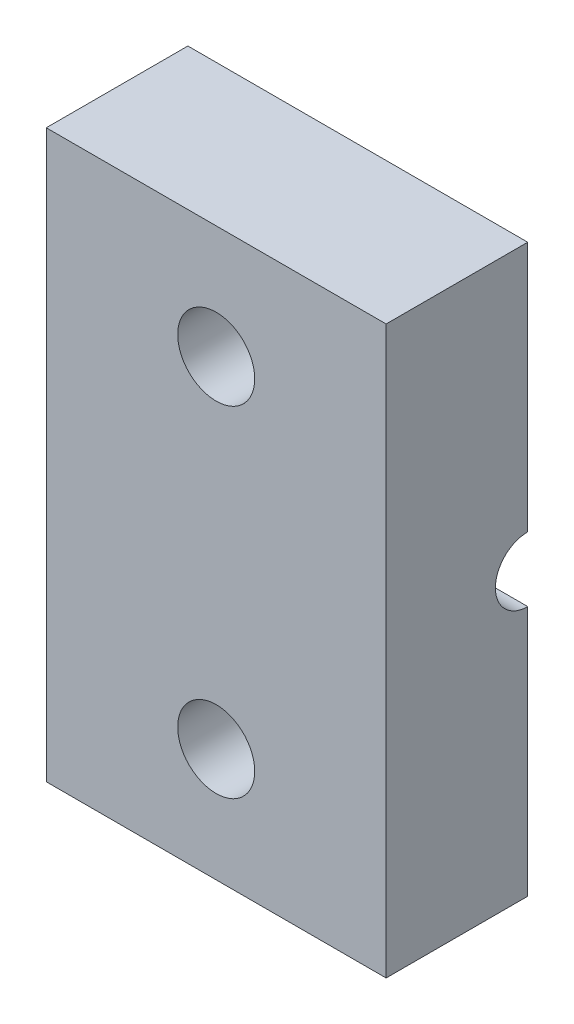
ISO-10303-21;
HEADER;
FILE_DESCRIPTION(('STEP AP214'),'2;1');
FILE_NAME('part.step','',(''),(''),'','','');
FILE_SCHEMA(('AUTOMOTIVE_DESIGN { 1 0 10303 214 1 1 1 1 }'));
ENDSEC;
DATA;
#1=APPLICATION_CONTEXT('core data for automotive mechanical design processes');
#2=APPLICATION_PROTOCOL_DEFINITION('international standard','automotive_design',2000,#1);
#3=PRODUCT_CONTEXT('',#1,'mechanical');
#4=PRODUCT('Part','Part','',(#3));
#5=PRODUCT_RELATED_PRODUCT_CATEGORY('part','',(#4));
#6=PRODUCT_DEFINITION_FORMATION('','',#4);
#7=PRODUCT_DEFINITION_CONTEXT('part definition',#1,'design');
#8=PRODUCT_DEFINITION('design','',#6,#7);
#9=PRODUCT_DEFINITION_SHAPE('','',#8);
#10=(LENGTH_UNIT() NAMED_UNIT(*) SI_UNIT(.MILLI.,.METRE.));
#11=(NAMED_UNIT(*) PLANE_ANGLE_UNIT() SI_UNIT($,.RADIAN.));
#12=(NAMED_UNIT(*) SI_UNIT($,.STERADIAN.) SOLID_ANGLE_UNIT());
#13=UNCERTAINTY_MEASURE_WITH_UNIT(LENGTH_MEASURE(1.E-05),#10,'distance_accuracy_value','');
#14=(GEOMETRIC_REPRESENTATION_CONTEXT(3) GLOBAL_UNCERTAINTY_ASSIGNED_CONTEXT((#13)) GLOBAL_UNIT_ASSIGNED_CONTEXT((#10,
#11,#12)) REPRESENTATION_CONTEXT('',''));
#15=CARTESIAN_POINT('',(0.,0.,0.));
#16=DIRECTION('',(0.,0.,1.));
#17=DIRECTION('',(1.,0.,0.));
#18=AXIS2_PLACEMENT_3D('',#15,#16,#17);
#19=CARTESIAN_POINT('',(0.,0.,0.));
#20=DIRECTION('',(0.,0.,1.));
#21=DIRECTION('',(1.,0.,0.));
#22=AXIS2_PLACEMENT_3D('',#19,#20,#21);
#23=PLANE('',#22);
#24=CARTESIAN_POINT('',(0.,7.62,0.));
#25=DIRECTION('',(0.,0.,1.));
#26=DIRECTION('',(1.,0.,0.));
#27=AXIS2_PLACEMENT_3D('',#24,#25,#26);
#28=CIRCLE('',#27,1.7272);
#29=CARTESIAN_POINT('',(1.7272,7.62,0.));
#30=VERTEX_POINT('',#29);
#31=EDGE_CURVE('E178',#30,#30,#28,.T.);
#32=ORIENTED_EDGE('',*,*,#31,.T.);
#33=EDGE_LOOP('',(#32));
#34=FACE_BOUND('',#33,.T.);
#35=DIRECTION('',(0.,1.,0.));
#36=VECTOR('',#35,1.);
#37=CARTESIAN_POINT('',(7.62,-12.7,0.));
#38=LINE('',#37,#36);
#39=CARTESIAN_POINT('',(7.62,1.45,0.));
#40=VERTEX_POINT('',#39);
#41=CARTESIAN_POINT('',(7.62,12.7,0.));
#42=VERTEX_POINT('',#41);
#43=EDGE_CURVE('E109',#40,#42,#38,.T.);
#44=ORIENTED_EDGE('',*,*,#43,.F.);
#45=DIRECTION('',(-1.,0.,0.));
#46=VECTOR('',#45,1.);
#47=CARTESIAN_POINT('',(7.62,1.45,0.));
#48=LINE('',#47,#46);
#49=CARTESIAN_POINT('',(-7.62,1.45,0.));
#50=VERTEX_POINT('',#49);
#51=EDGE_CURVE('E11',#40,#50,#48,.T.);
#52=ORIENTED_EDGE('',*,*,#51,.T.);
#53=DIRECTION('',(0.,-1.,0.));
#54=VECTOR('',#53,1.);
#55=CARTESIAN_POINT('',(-7.62,-12.7,0.));
#56=LINE('',#55,#54);
#57=CARTESIAN_POINT('',(-7.62,12.7,0.));
#58=VERTEX_POINT('',#57);
#59=EDGE_CURVE('E108',#58,#50,#56,.T.);
#60=ORIENTED_EDGE('',*,*,#59,.F.);
#61=DIRECTION('',(-1.,0.,0.));
#62=VECTOR('',#61,1.);
#63=CARTESIAN_POINT('',(7.62,12.7,0.));
#64=LINE('',#63,#62);
#65=EDGE_CURVE('E83',#42,#58,#64,.T.);
#66=ORIENTED_EDGE('',*,*,#65,.F.);
#67=EDGE_LOOP('',(#44,#52,#60,#66));
#68=FACE_BOUND('',#67,.T.);
#69=ADVANCED_FACE('F38',(#34,#68),#23,.F.);
#70=CARTESIAN_POINT('',(-7.62,-12.7,6.35));
#71=DIRECTION('',(1.,0.,0.));
#72=DIRECTION('',(0.,0.,-1.));
#73=AXIS2_PLACEMENT_3D('',#70,#71,#72);
#74=PLANE('',#73);
#75=ORIENTED_EDGE('',*,*,#59,.T.);
#76=CARTESIAN_POINT('',(-7.62,0.,0.));
#77=DIRECTION('',(-1.,0.,0.));
#78=DIRECTION('',(0.,0.,1.));
#79=AXIS2_PLACEMENT_3D('',#76,#77,#78);
#80=CIRCLE('',#79,1.45);
#81=CARTESIAN_POINT('',(-7.62,-1.45,0.));
#82=VERTEX_POINT('',#81);
#83=EDGE_CURVE('E99',#82,#50,#80,.T.);
#84=ORIENTED_EDGE('',*,*,#83,.F.);
#85=CARTESIAN_POINT('',(-7.62,-12.7,0.));
#86=VERTEX_POINT('',#85);
#87=EDGE_CURVE('E113',#82,#86,#56,.T.);
#88=ORIENTED_EDGE('',*,*,#87,.T.);
#89=DIRECTION('',(0.,0.,-1.));
#90=VECTOR('',#89,1.);
#91=CARTESIAN_POINT('',(-7.62,-12.7,6.35));
#92=LINE('',#91,#90);
#93=CARTESIAN_POINT('',(-7.62,-12.7,6.35));
#94=VERTEX_POINT('',#93);
#95=EDGE_CURVE('E131',#94,#86,#92,.T.);
#96=ORIENTED_EDGE('',*,*,#95,.F.);
#97=DIRECTION('',(0.,-1.,0.));
#98=VECTOR('',#97,1.);
#99=CARTESIAN_POINT('',(-7.62,-12.7,6.35));
#100=LINE('',#99,#98);
#101=CARTESIAN_POINT('',(-7.62,12.7,6.35));
#102=VERTEX_POINT('',#101);
#103=EDGE_CURVE('E124',#102,#94,#100,.T.);
#104=ORIENTED_EDGE('',*,*,#103,.F.);
#105=DIRECTION('',(0.,0.,-1.));
#106=VECTOR('',#105,1.);
#107=CARTESIAN_POINT('',(-7.62,12.7,6.35));
#108=LINE('',#107,#106);
#109=EDGE_CURVE('E111',#102,#58,#108,.T.);
#110=ORIENTED_EDGE('',*,*,#109,.T.);
#111=EDGE_LOOP('',(#75,#84,#88,#96,#104,#110));
#112=FACE_BOUND('',#111,.T.);
#113=ADVANCED_FACE('F40',(#112),#74,.F.);
#114=CARTESIAN_POINT('',(7.62,-12.7,6.35));
#115=DIRECTION('',(0.,1.,0.));
#116=DIRECTION('',(-1.,0.,0.));
#117=AXIS2_PLACEMENT_3D('',#114,#115,#116);
#118=PLANE('',#117);
#119=DIRECTION('',(1.,0.,0.));
#120=VECTOR('',#119,1.);
#121=CARTESIAN_POINT('',(7.62,-12.7,0.));
#122=LINE('',#121,#120);
#123=CARTESIAN_POINT('',(7.62,-12.7,0.));
#124=VERTEX_POINT('',#123);
#125=EDGE_CURVE('E112',#86,#124,#122,.T.);
#126=ORIENTED_EDGE('',*,*,#125,.T.);
#127=DIRECTION('',(0.,0.,-1.));
#128=VECTOR('',#127,1.);
#129=CARTESIAN_POINT('',(7.62,-12.7,6.35));
#130=LINE('',#129,#128);
#131=CARTESIAN_POINT('',(7.62,-12.7,6.35));
#132=VERTEX_POINT('',#131);
#133=EDGE_CURVE('E128',#132,#124,#130,.T.);
#134=ORIENTED_EDGE('',*,*,#133,.F.);
#135=DIRECTION('',(1.,0.,0.));
#136=VECTOR('',#135,1.);
#137=CARTESIAN_POINT('',(7.62,-12.7,6.35));
#138=LINE('',#137,#136);
#139=EDGE_CURVE('E91',#94,#132,#138,.T.);
#140=ORIENTED_EDGE('',*,*,#139,.F.);
#141=ORIENTED_EDGE('',*,*,#95,.T.);
#142=EDGE_LOOP('',(#126,#134,#140,#141));
#143=FACE_BOUND('',#142,.T.);
#144=ADVANCED_FACE('F141',(#143),#118,.F.);
#145=CARTESIAN_POINT('',(7.62,-12.7,6.35));
#146=DIRECTION('',(-1.,0.,0.));
#147=DIRECTION('',(0.,-1.,0.));
#148=AXIS2_PLACEMENT_3D('',#145,#146,#147);
#149=PLANE('',#148);
#150=CARTESIAN_POINT('',(7.62,-1.45,0.));
#151=VERTEX_POINT('',#150);
#152=EDGE_CURVE('E120',#124,#151,#38,.T.);
#153=ORIENTED_EDGE('',*,*,#152,.T.);
#154=CARTESIAN_POINT('',(7.62,0.,0.));
#155=DIRECTION('',(-1.,0.,0.));
#156=DIRECTION('',(0.,0.,1.));
#157=AXIS2_PLACEMENT_3D('',#154,#155,#156);
#158=CIRCLE('',#157,1.45);
#159=EDGE_CURVE('E53',#151,#40,#158,.T.);
#160=ORIENTED_EDGE('',*,*,#159,.T.);
#161=ORIENTED_EDGE('',*,*,#43,.T.);
#162=DIRECTION('',(0.,0.,-1.));
#163=VECTOR('',#162,1.);
#164=CARTESIAN_POINT('',(7.62,12.7,6.35));
#165=LINE('',#164,#163);
#166=CARTESIAN_POINT('',(7.62,12.7,6.35));
#167=VERTEX_POINT('',#166);
#168=EDGE_CURVE('E126',#167,#42,#165,.T.);
#169=ORIENTED_EDGE('',*,*,#168,.F.);
#170=DIRECTION('',(0.,1.,0.));
#171=VECTOR('',#170,1.);
#172=CARTESIAN_POINT('',(7.62,-12.7,6.35));
#173=LINE('',#172,#171);
#174=EDGE_CURVE('E140',#132,#167,#173,.T.);
#175=ORIENTED_EDGE('',*,*,#174,.F.);
#176=ORIENTED_EDGE('',*,*,#133,.T.);
#177=EDGE_LOOP('',(#153,#160,#161,#169,#175,#176));
#178=FACE_BOUND('',#177,.T.);
#179=ADVANCED_FACE('F137',(#178),#149,.F.);
#180=CARTESIAN_POINT('',(7.62,12.7,6.35));
#181=DIRECTION('',(0.,-1.,0.));
#182=DIRECTION('',(1.,0.,0.));
#183=AXIS2_PLACEMENT_3D('',#180,#181,#182);
#184=PLANE('',#183);
#185=ORIENTED_EDGE('',*,*,#65,.T.);
#186=ORIENTED_EDGE('',*,*,#109,.F.);
#187=DIRECTION('',(-1.,0.,0.));
#188=VECTOR('',#187,1.);
#189=CARTESIAN_POINT('',(7.62,12.7,6.35));
#190=LINE('',#189,#188);
#191=EDGE_CURVE('E62',#167,#102,#190,.T.);
#192=ORIENTED_EDGE('',*,*,#191,.F.);
#193=ORIENTED_EDGE('',*,*,#168,.T.);
#194=EDGE_LOOP('',(#185,#186,#192,#193));
#195=FACE_BOUND('',#194,.T.);
#196=ADVANCED_FACE('F148',(#195),#184,.F.);
#197=CARTESIAN_POINT('',(0.,0.,6.35));
#198=DIRECTION('',(0.,0.,1.));
#199=DIRECTION('',(1.,0.,0.));
#200=AXIS2_PLACEMENT_3D('',#197,#198,#199);
#201=PLANE('',#200);
#202=CARTESIAN_POINT('',(0.,7.62,6.35));
#203=DIRECTION('',(0.,0.,1.));
#204=DIRECTION('',(1.,0.,0.));
#205=AXIS2_PLACEMENT_3D('',#202,#203,#204);
#206=CIRCLE('',#205,1.72719999999999);
#207=CARTESIAN_POINT('',(1.72719999999999,7.62,6.35));
#208=VERTEX_POINT('',#207);
#209=EDGE_CURVE('E181',#208,#208,#206,.T.);
#210=ORIENTED_EDGE('',*,*,#209,.F.);
#211=EDGE_LOOP('',(#210));
#212=FACE_BOUND('',#211,.T.);
#213=CARTESIAN_POINT('',(0.,-7.62,6.35));
#214=DIRECTION('',(0.,0.,1.));
#215=DIRECTION('',(1.,0.,0.));
#216=AXIS2_PLACEMENT_3D('',#213,#214,#215);
#217=CIRCLE('',#216,1.72719999999999);
#218=CARTESIAN_POINT('',(1.72719999999999,-7.62,6.35));
#219=VERTEX_POINT('',#218);
#220=EDGE_CURVE('E176',#219,#219,#217,.T.);
#221=ORIENTED_EDGE('',*,*,#220,.F.);
#222=EDGE_LOOP('',(#221));
#223=FACE_BOUND('',#222,.T.);
#224=ORIENTED_EDGE('',*,*,#103,.T.);
#225=ORIENTED_EDGE('',*,*,#139,.T.);
#226=ORIENTED_EDGE('',*,*,#174,.T.);
#227=ORIENTED_EDGE('',*,*,#191,.T.);
#228=EDGE_LOOP('',(#224,#225,#226,#227));
#229=FACE_BOUND('',#228,.T.);
#230=ADVANCED_FACE('F147',(#212,#223,#229),#201,.T.);
#231=CARTESIAN_POINT('',(0.,-7.62,0.));
#232=DIRECTION('',(0.,0.,1.));
#233=DIRECTION('',(1.,0.,0.));
#234=AXIS2_PLACEMENT_3D('',#231,#232,#233);
#235=CIRCLE('',#234,1.7272);
#236=CARTESIAN_POINT('',(1.7272,-7.62,0.));
#237=VERTEX_POINT('',#236);
#238=EDGE_CURVE('E116',#237,#237,#235,.T.);
#239=ORIENTED_EDGE('',*,*,#238,.T.);
#240=EDGE_LOOP('',(#239));
#241=FACE_BOUND('',#240,.T.);
#242=ORIENTED_EDGE('',*,*,#87,.F.);
#243=DIRECTION('',(-1.,0.,0.));
#244=VECTOR('',#243,1.);
#245=CARTESIAN_POINT('',(7.62,-1.45,0.));
#246=LINE('',#245,#244);
#247=EDGE_CURVE('E46',#82,#151,#246,.F.);
#248=ORIENTED_EDGE('',*,*,#247,.T.);
#249=ORIENTED_EDGE('',*,*,#152,.F.);
#250=ORIENTED_EDGE('',*,*,#125,.F.);
#251=EDGE_LOOP('',(#242,#248,#249,#250));
#252=FACE_BOUND('',#251,.T.);
#253=ADVANCED_FACE('F134',(#241,#252),#23,.F.);
#254=CARTESIAN_POINT('',(0.,-7.62,6.35));
#255=DIRECTION('',(0.,0.,1.));
#256=DIRECTION('',(1.,0.,0.));
#257=AXIS2_PLACEMENT_3D('',#254,#255,#256);
#258=CYLINDRICAL_SURFACE('',#257,1.72719999999999);
#259=ORIENTED_EDGE('',*,*,#238,.F.);
#260=EDGE_LOOP('',(#259));
#261=FACE_BOUND('',#260,.T.);
#262=ORIENTED_EDGE('',*,*,#220,.T.);
#263=EDGE_LOOP('',(#262));
#264=FACE_BOUND('',#263,.T.);
#265=ADVANCED_FACE('F166',(#261,#264),#258,.F.);
#266=CARTESIAN_POINT('',(0.,7.62,6.35));
#267=DIRECTION('',(0.,0.,1.));
#268=DIRECTION('',(1.,0.,0.));
#269=AXIS2_PLACEMENT_3D('',#266,#267,#268);
#270=CYLINDRICAL_SURFACE('',#269,1.72719999999999);
#271=ORIENTED_EDGE('',*,*,#31,.F.);
#272=EDGE_LOOP('',(#271));
#273=FACE_BOUND('',#272,.T.);
#274=ORIENTED_EDGE('',*,*,#209,.T.);
#275=EDGE_LOOP('',(#274));
#276=FACE_BOUND('',#275,.T.);
#277=ADVANCED_FACE('F171',(#273,#276),#270,.F.);
#278=CARTESIAN_POINT('',(7.62,0.,0.));
#279=DIRECTION('',(-1.,0.,0.));
#280=DIRECTION('',(0.,0.,1.));
#281=AXIS2_PLACEMENT_3D('',#278,#279,#280);
#282=CYLINDRICAL_SURFACE('',#281,1.45);
#283=ORIENTED_EDGE('',*,*,#159,.F.);
#284=ORIENTED_EDGE('',*,*,#247,.F.);
#285=ORIENTED_EDGE('',*,*,#83,.T.);
#286=ORIENTED_EDGE('',*,*,#51,.F.);
#287=EDGE_LOOP('',(#283,#284,#285,#286));
#288=FACE_BOUND('',#287,.T.);
#289=ADVANCED_FACE('F100',(#288),#282,.F.);
#290=CLOSED_SHELL('',(#69,#113,#144,#179,#196,#230,#253,#265,#277,#289));
#291=MANIFOLD_SOLID_BREP('B2',#290);
#292=ADVANCED_BREP_SHAPE_REPRESENTATION('',(#18,#291),#14);
#293=SHAPE_DEFINITION_REPRESENTATION(#9,#292);
ENDSEC;
END-ISO-10303-21;
